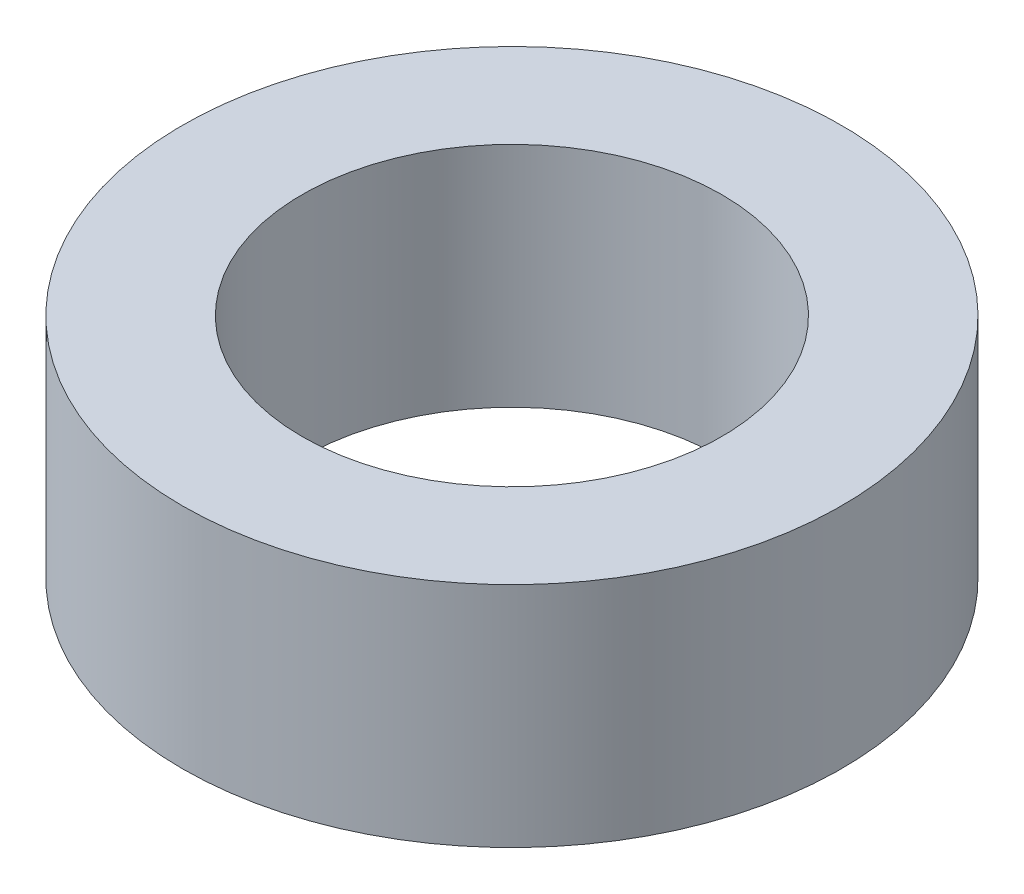
ISO-10303-21;
HEADER;
FILE_DESCRIPTION(('STEP AP214'),'2;1');
FILE_NAME('part.step','',(''),(''),'','','');
FILE_SCHEMA(('AUTOMOTIVE_DESIGN { 1 0 10303 214 1 1 1 1 }'));
ENDSEC;
DATA;
#1=APPLICATION_CONTEXT('core data for automotive mechanical design processes');
#2=APPLICATION_PROTOCOL_DEFINITION('international standard','automotive_design',2000,#1);
#3=PRODUCT_CONTEXT('',#1,'mechanical');
#4=PRODUCT('Part','Part','',(#3));
#5=PRODUCT_RELATED_PRODUCT_CATEGORY('part','',(#4));
#6=PRODUCT_DEFINITION_FORMATION('','',#4);
#7=PRODUCT_DEFINITION_CONTEXT('part definition',#1,'design');
#8=PRODUCT_DEFINITION('design','',#6,#7);
#9=PRODUCT_DEFINITION_SHAPE('','',#8);
#10=(LENGTH_UNIT() NAMED_UNIT(*) SI_UNIT(.MILLI.,.METRE.));
#11=(NAMED_UNIT(*) PLANE_ANGLE_UNIT() SI_UNIT($,.RADIAN.));
#12=(NAMED_UNIT(*) SI_UNIT($,.STERADIAN.) SOLID_ANGLE_UNIT());
#13=UNCERTAINTY_MEASURE_WITH_UNIT(LENGTH_MEASURE(1.E-05),#10,'distance_accuracy_value','');
#14=(GEOMETRIC_REPRESENTATION_CONTEXT(3) GLOBAL_UNCERTAINTY_ASSIGNED_CONTEXT((#13)) GLOBAL_UNIT_ASSIGNED_CONTEXT((#10,
#11,#12)) REPRESENTATION_CONTEXT('',''));
#15=CARTESIAN_POINT('',(0.,0.,0.));
#16=DIRECTION('',(0.,0.,1.));
#17=DIRECTION('',(1.,0.,0.));
#18=AXIS2_PLACEMENT_3D('',#15,#16,#17);
#19=CARTESIAN_POINT('',(0.,19.,0.));
#20=DIRECTION('',(0.,-1.,0.));
#21=DIRECTION('',(0.,0.,-1.));
#22=AXIS2_PLACEMENT_3D('',#19,#20,#21);
#23=CYLINDRICAL_SURFACE('',#22,27.5);
#24=CARTESIAN_POINT('',(0.,19.,0.));
#25=DIRECTION('',(0.,1.,0.));
#26=DIRECTION('',(0.,0.,1.));
#27=AXIS2_PLACEMENT_3D('',#24,#25,#26);
#28=CIRCLE('',#27,27.5);
#29=CARTESIAN_POINT('',(0.,19.,27.5));
#30=VERTEX_POINT('',#29);
#31=EDGE_CURVE('E10',#30,#30,#28,.T.);
#32=ORIENTED_EDGE('',*,*,#31,.F.);
#33=EDGE_LOOP('',(#32));
#34=FACE_BOUND('',#33,.T.);
#35=CARTESIAN_POINT('',(0.,0.,0.));
#36=DIRECTION('',(0.,1.,0.));
#37=DIRECTION('',(0.,0.,1.));
#38=AXIS2_PLACEMENT_3D('',#35,#36,#37);
#39=CIRCLE('',#38,27.5);
#40=CARTESIAN_POINT('',(0.,0.,27.5));
#41=VERTEX_POINT('',#40);
#42=EDGE_CURVE('E37',#41,#41,#39,.T.);
#43=ORIENTED_EDGE('',*,*,#42,.T.);
#44=EDGE_LOOP('',(#43));
#45=FACE_BOUND('',#44,.T.);
#46=ADVANCED_FACE('F40',(#34,#45),#23,.T.);
#47=CARTESIAN_POINT('',(0.,19.,0.));
#48=DIRECTION('',(0.,1.,0.));
#49=DIRECTION('',(0.,0.,1.));
#50=AXIS2_PLACEMENT_3D('',#47,#48,#49);
#51=PLANE('',#50);
#52=CARTESIAN_POINT('',(0.,19.,0.));
#53=DIRECTION('',(0.,1.,0.));
#54=DIRECTION('',(0.,0.,1.));
#55=AXIS2_PLACEMENT_3D('',#52,#53,#54);
#56=CIRCLE('',#55,17.5);
#57=CARTESIAN_POINT('',(0.,19.,17.5));
#58=VERTEX_POINT('',#57);
#59=EDGE_CURVE('E50',#58,#58,#56,.T.);
#60=ORIENTED_EDGE('',*,*,#59,.F.);
#61=EDGE_LOOP('',(#60));
#62=FACE_BOUND('',#61,.T.);
#63=ORIENTED_EDGE('',*,*,#31,.T.);
#64=EDGE_LOOP('',(#63));
#65=FACE_BOUND('',#64,.T.);
#66=ADVANCED_FACE('F59',(#62,#65),#51,.T.);
#67=CARTESIAN_POINT('',(0.,0.,0.));
#68=DIRECTION('',(0.,1.,0.));
#69=DIRECTION('',(0.,0.,1.));
#70=AXIS2_PLACEMENT_3D('',#67,#68,#69);
#71=PLANE('',#70);
#72=CARTESIAN_POINT('',(0.,0.,0.));
#73=DIRECTION('',(0.,1.,0.));
#74=DIRECTION('',(0.,0.,1.));
#75=AXIS2_PLACEMENT_3D('',#72,#73,#74);
#76=CIRCLE('',#75,17.5);
#77=CARTESIAN_POINT('',(0.,0.,17.5));
#78=VERTEX_POINT('',#77);
#79=EDGE_CURVE('E47',#78,#78,#76,.T.);
#80=ORIENTED_EDGE('',*,*,#79,.T.);
#81=EDGE_LOOP('',(#80));
#82=FACE_BOUND('',#81,.T.);
#83=ORIENTED_EDGE('',*,*,#42,.F.);
#84=EDGE_LOOP('',(#83));
#85=FACE_BOUND('',#84,.T.);
#86=ADVANCED_FACE('F58',(#82,#85),#71,.F.);
#87=CARTESIAN_POINT('',(0.,19.,0.));
#88=DIRECTION('',(0.,-1.,0.));
#89=DIRECTION('',(0.,0.,-1.));
#90=AXIS2_PLACEMENT_3D('',#87,#88,#89);
#91=CYLINDRICAL_SURFACE('',#90,17.5);
#92=ORIENTED_EDGE('',*,*,#59,.T.);
#93=EDGE_LOOP('',(#92));
#94=FACE_BOUND('',#93,.T.);
#95=ORIENTED_EDGE('',*,*,#79,.F.);
#96=EDGE_LOOP('',(#95));
#97=FACE_BOUND('',#96,.T.);
#98=ADVANCED_FACE('F54',(#94,#97),#91,.F.);
#99=CLOSED_SHELL('',(#46,#66,#86,#98));
#100=MANIFOLD_SOLID_BREP('B2',#99);
#101=ADVANCED_BREP_SHAPE_REPRESENTATION('',(#18,#100),#14);
#102=SHAPE_DEFINITION_REPRESENTATION(#9,#101);
ENDSEC;
END-ISO-10303-21;
